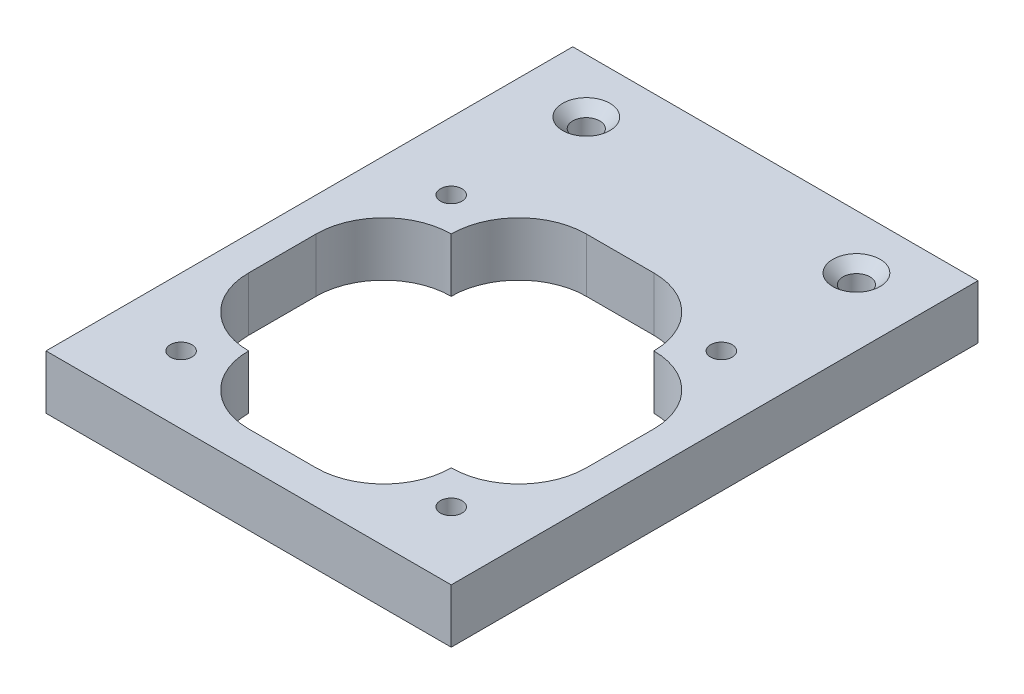
ISO-10303-21;
HEADER;
FILE_DESCRIPTION(('STEP AP214'),'2;1');
FILE_NAME('part.step','',(''),(''),'','','');
FILE_SCHEMA(('AUTOMOTIVE_DESIGN { 1 0 10303 214 1 1 1 1 }'));
ENDSEC;
DATA;
#1=APPLICATION_CONTEXT('core data for automotive mechanical design processes');
#2=APPLICATION_PROTOCOL_DEFINITION('international standard','automotive_design',2000,#1);
#3=PRODUCT_CONTEXT('',#1,'mechanical');
#4=PRODUCT('Part','Part','',(#3));
#5=PRODUCT_RELATED_PRODUCT_CATEGORY('part','',(#4));
#6=PRODUCT_DEFINITION_FORMATION('','',#4);
#7=PRODUCT_DEFINITION_CONTEXT('part definition',#1,'design');
#8=PRODUCT_DEFINITION('design','',#6,#7);
#9=PRODUCT_DEFINITION_SHAPE('','',#8);
#10=(LENGTH_UNIT() NAMED_UNIT(*) SI_UNIT(.MILLI.,.METRE.));
#11=(NAMED_UNIT(*) PLANE_ANGLE_UNIT() SI_UNIT($,.RADIAN.));
#12=(NAMED_UNIT(*) SI_UNIT($,.STERADIAN.) SOLID_ANGLE_UNIT());
#13=UNCERTAINTY_MEASURE_WITH_UNIT(LENGTH_MEASURE(1.E-05),#10,'distance_accuracy_value','');
#14=(GEOMETRIC_REPRESENTATION_CONTEXT(3) GLOBAL_UNCERTAINTY_ASSIGNED_CONTEXT((#13)) GLOBAL_UNIT_ASSIGNED_CONTEXT((#10,
#11,#12)) REPRESENTATION_CONTEXT('',''));
#15=CARTESIAN_POINT('',(0.,0.,0.));
#16=DIRECTION('',(0.,0.,1.));
#17=DIRECTION('',(1.,0.,0.));
#18=AXIS2_PLACEMENT_3D('',#15,#16,#17);
#19=CARTESIAN_POINT('',(0.,0.,0.));
#20=DIRECTION('',(0.,-1.,0.));
#21=DIRECTION('',(0.,0.,-1.));
#22=AXIS2_PLACEMENT_3D('',#19,#20,#21);
#23=PLANE('',#22);
#24=CARTESIAN_POINT('',(-2.5,0.,-7.5));
#25=DIRECTION('',(0.,-1.,0.));
#26=DIRECTION('',(0.,0.,-1.));
#27=AXIS2_PLACEMENT_3D('',#24,#25,#26);
#28=CIRCLE('',#27,5.);
#29=CARTESIAN_POINT('',(-2.5,0.,-12.5));
#30=VERTEX_POINT('',#29);
#31=CARTESIAN_POINT('',(-7.5,0.,-7.5));
#32=VERTEX_POINT('',#31);
#33=EDGE_CURVE('E286',#30,#32,#28,.F.);
#34=ORIENTED_EDGE('',*,*,#33,.T.);
#35=CARTESIAN_POINT('',(-7.5,0.,-2.5));
#36=DIRECTION('',(0.,-1.,0.));
#37=DIRECTION('',(0.,0.,-1.));
#38=AXIS2_PLACEMENT_3D('',#35,#36,#37);
#39=CIRCLE('',#38,5.);
#40=CARTESIAN_POINT('',(-12.5,0.,-2.5));
#41=VERTEX_POINT('',#40);
#42=EDGE_CURVE('E47',#32,#41,#39,.F.);
#43=ORIENTED_EDGE('',*,*,#42,.T.);
#44=DIRECTION('',(0.,0.,1.));
#45=VECTOR('',#44,1.);
#46=CARTESIAN_POINT('',(-12.5,0.,7.5));
#47=LINE('',#46,#45);
#48=CARTESIAN_POINT('',(-12.5,0.,2.5));
#49=VERTEX_POINT('',#48);
#50=EDGE_CURVE('E178',#41,#49,#47,.T.);
#51=ORIENTED_EDGE('',*,*,#50,.T.);
#52=CARTESIAN_POINT('',(-7.5,0.,2.5));
#53=DIRECTION('',(0.,-1.,0.));
#54=DIRECTION('',(0.,0.,-1.));
#55=AXIS2_PLACEMENT_3D('',#52,#53,#54);
#56=CIRCLE('',#55,5.);
#57=CARTESIAN_POINT('',(-7.5,0.,7.5));
#58=VERTEX_POINT('',#57);
#59=EDGE_CURVE('E164',#49,#58,#56,.F.);
#60=ORIENTED_EDGE('',*,*,#59,.T.);
#61=CARTESIAN_POINT('',(-2.5,0.,7.5));
#62=DIRECTION('',(0.,-1.,0.));
#63=DIRECTION('',(0.,0.,-1.));
#64=AXIS2_PLACEMENT_3D('',#61,#62,#63);
#65=CIRCLE('',#64,5.);
#66=CARTESIAN_POINT('',(-2.5,0.,12.5));
#67=VERTEX_POINT('',#66);
#68=EDGE_CURVE('E165',#58,#67,#65,.F.);
#69=ORIENTED_EDGE('',*,*,#68,.T.);
#70=DIRECTION('',(1.,0.,0.));
#71=VECTOR('',#70,1.);
#72=CARTESIAN_POINT('',(7.5,0.,12.5));
#73=LINE('',#72,#71);
#74=CARTESIAN_POINT('',(2.5,0.,12.5));
#75=VERTEX_POINT('',#74);
#76=EDGE_CURVE('E182',#67,#75,#73,.T.);
#77=ORIENTED_EDGE('',*,*,#76,.T.);
#78=CARTESIAN_POINT('',(2.5,0.,7.5));
#79=DIRECTION('',(0.,-1.,0.));
#80=DIRECTION('',(0.,0.,-1.));
#81=AXIS2_PLACEMENT_3D('',#78,#79,#80);
#82=CIRCLE('',#81,5.);
#83=CARTESIAN_POINT('',(7.5,0.,7.5));
#84=VERTEX_POINT('',#83);
#85=EDGE_CURVE('E274',#75,#84,#82,.F.);
#86=ORIENTED_EDGE('',*,*,#85,.T.);
#87=CARTESIAN_POINT('',(7.5,0.,2.5));
#88=DIRECTION('',(0.,-1.,0.));
#89=DIRECTION('',(0.,0.,-1.));
#90=AXIS2_PLACEMENT_3D('',#87,#88,#89);
#91=CIRCLE('',#90,5.);
#92=CARTESIAN_POINT('',(12.5,0.,2.5));
#93=VERTEX_POINT('',#92);
#94=EDGE_CURVE('E175',#84,#93,#91,.F.);
#95=ORIENTED_EDGE('',*,*,#94,.T.);
#96=DIRECTION('',(0.,0.,-1.));
#97=VECTOR('',#96,1.);
#98=CARTESIAN_POINT('',(12.5,0.,-7.5));
#99=LINE('',#98,#97);
#100=CARTESIAN_POINT('',(12.5,0.,-2.5));
#101=VERTEX_POINT('',#100);
#102=EDGE_CURVE('E218',#93,#101,#99,.T.);
#103=ORIENTED_EDGE('',*,*,#102,.T.);
#104=CARTESIAN_POINT('',(7.5,0.,-2.5));
#105=DIRECTION('',(0.,-1.,0.));
#106=DIRECTION('',(0.,0.,-1.));
#107=AXIS2_PLACEMENT_3D('',#104,#105,#106);
#108=CIRCLE('',#107,5.);
#109=CARTESIAN_POINT('',(7.5,0.,-7.5));
#110=VERTEX_POINT('',#109);
#111=EDGE_CURVE('E278',#101,#110,#108,.F.);
#112=ORIENTED_EDGE('',*,*,#111,.T.);
#113=CARTESIAN_POINT('',(2.5,0.,-7.5));
#114=DIRECTION('',(0.,-1.,0.));
#115=DIRECTION('',(0.,0.,-1.));
#116=AXIS2_PLACEMENT_3D('',#113,#114,#115);
#117=CIRCLE('',#116,5.);
#118=CARTESIAN_POINT('',(2.5,0.,-12.5));
#119=VERTEX_POINT('',#118);
#120=EDGE_CURVE('E282',#110,#119,#117,.F.);
#121=ORIENTED_EDGE('',*,*,#120,.T.);
#122=DIRECTION('',(-1.,0.,0.));
#123=VECTOR('',#122,1.);
#124=CARTESIAN_POINT('',(-7.5,0.,-12.5));
#125=LINE('',#124,#123);
#126=EDGE_CURVE('E208',#119,#30,#125,.T.);
#127=ORIENTED_EDGE('',*,*,#126,.T.);
#128=EDGE_LOOP('',(#34,#43,#51,#60,#69,#77,#86,#95,#103,#112,#121,#127));
#129=FACE_BOUND('',#128,.T.);
#130=DIRECTION('',(0.,0.,1.));
#131=VECTOR('',#130,1.);
#132=CARTESIAN_POINT('',(-15.,0.,-15.));
#133=LINE('',#132,#131);
#134=CARTESIAN_POINT('',(-15.,0.,-24.));
#135=VERTEX_POINT('',#134);
#136=CARTESIAN_POINT('',(-15.,0.,15.));
#137=VERTEX_POINT('',#136);
#138=EDGE_CURVE('E214',#135,#137,#133,.T.);
#139=ORIENTED_EDGE('',*,*,#138,.F.);
#140=DIRECTION('',(-1.,0.,0.));
#141=VECTOR('',#140,1.);
#142=CARTESIAN_POINT('',(-15.,0.,-24.));
#143=LINE('',#142,#141);
#144=CARTESIAN_POINT('',(15.,0.,-24.));
#145=VERTEX_POINT('',#144);
#146=EDGE_CURVE('E226',#145,#135,#143,.T.);
#147=ORIENTED_EDGE('',*,*,#146,.F.);
#148=DIRECTION('',(0.,0.,-1.));
#149=VECTOR('',#148,1.);
#150=CARTESIAN_POINT('',(15.,0.,-24.));
#151=LINE('',#150,#149);
#152=CARTESIAN_POINT('',(15.,0.,15.));
#153=VERTEX_POINT('',#152);
#154=EDGE_CURVE('E237',#153,#145,#151,.T.);
#155=ORIENTED_EDGE('',*,*,#154,.F.);
#156=DIRECTION('',(1.,0.,0.));
#157=VECTOR('',#156,1.);
#158=CARTESIAN_POINT('',(-15.,0.,15.));
#159=LINE('',#158,#157);
#160=EDGE_CURVE('E234',#137,#153,#159,.T.);
#161=ORIENTED_EDGE('',*,*,#160,.F.);
#162=EDGE_LOOP('',(#139,#147,#155,#161));
#163=FACE_BOUND('',#162,.T.);
#164=CARTESIAN_POINT('',(10.,0.,-20.));
#165=DIRECTION('',(0.,1.,0.));
#166=DIRECTION('',(0.,0.,1.));
#167=AXIS2_PLACEMENT_3D('',#164,#165,#166);
#168=CIRCLE('',#167,0.999999999999997);
#169=CARTESIAN_POINT('',(10.,0.,-19.));
#170=VERTEX_POINT('',#169);
#171=EDGE_CURVE('E193',#170,#170,#168,.T.);
#172=ORIENTED_EDGE('',*,*,#171,.T.);
#173=EDGE_LOOP('',(#172));
#174=FACE_BOUND('',#173,.T.);
#175=CARTESIAN_POINT('',(-10.,0.,-20.));
#176=DIRECTION('',(0.,1.,0.));
#177=DIRECTION('',(0.,0.,1.));
#178=AXIS2_PLACEMENT_3D('',#175,#176,#177);
#179=CIRCLE('',#178,0.999999999999997);
#180=CARTESIAN_POINT('',(-10.,0.,-19.));
#181=VERTEX_POINT('',#180);
#182=EDGE_CURVE('E442',#181,#181,#179,.T.);
#183=ORIENTED_EDGE('',*,*,#182,.T.);
#184=EDGE_LOOP('',(#183));
#185=FACE_BOUND('',#184,.T.);
#186=CARTESIAN_POINT('',(-10.,0.,10.));
#187=DIRECTION('',(0.,1.,0.));
#188=DIRECTION('',(0.,0.,1.));
#189=AXIS2_PLACEMENT_3D('',#186,#187,#188);
#190=CIRCLE('',#189,0.799999999999999);
#191=CARTESIAN_POINT('',(-10.,0.,10.8));
#192=VERTEX_POINT('',#191);
#193=EDGE_CURVE('E433',#192,#192,#190,.T.);
#194=ORIENTED_EDGE('',*,*,#193,.T.);
#195=EDGE_LOOP('',(#194));
#196=FACE_BOUND('',#195,.T.);
#197=CARTESIAN_POINT('',(10.,0.,10.));
#198=DIRECTION('',(0.,1.,0.));
#199=DIRECTION('',(0.,0.,1.));
#200=AXIS2_PLACEMENT_3D('',#197,#198,#199);
#201=CIRCLE('',#200,0.799999999999999);
#202=CARTESIAN_POINT('',(10.,0.,10.8));
#203=VERTEX_POINT('',#202);
#204=EDGE_CURVE('E427',#203,#203,#201,.T.);
#205=ORIENTED_EDGE('',*,*,#204,.T.);
#206=EDGE_LOOP('',(#205));
#207=FACE_BOUND('',#206,.T.);
#208=CARTESIAN_POINT('',(10.,0.,-10.));
#209=DIRECTION('',(0.,1.,0.));
#210=DIRECTION('',(0.,0.,1.));
#211=AXIS2_PLACEMENT_3D('',#208,#209,#210);
#212=CIRCLE('',#211,0.799999999999999);
#213=CARTESIAN_POINT('',(10.,0.,-9.20000000000001));
#214=VERTEX_POINT('',#213);
#215=EDGE_CURVE('E421',#214,#214,#212,.T.);
#216=ORIENTED_EDGE('',*,*,#215,.T.);
#217=EDGE_LOOP('',(#216));
#218=FACE_BOUND('',#217,.T.);
#219=CARTESIAN_POINT('',(-10.,0.,-10.));
#220=DIRECTION('',(0.,1.,0.));
#221=DIRECTION('',(0.,0.,1.));
#222=AXIS2_PLACEMENT_3D('',#219,#220,#221);
#223=CIRCLE('',#222,0.799999999999999);
#224=CARTESIAN_POINT('',(-10.,0.,-9.20000000000001));
#225=VERTEX_POINT('',#224);
#226=EDGE_CURVE('E411',#225,#225,#223,.T.);
#227=ORIENTED_EDGE('',*,*,#226,.T.);
#228=EDGE_LOOP('',(#227));
#229=FACE_BOUND('',#228,.T.);
#230=ADVANCED_FACE('F38',(#129,#163,#174,#185,#196,#207,#218,#229),#23,.T.);
#231=CARTESIAN_POINT('',(0.,4.,0.));
#232=DIRECTION('',(0.,-1.,0.));
#233=DIRECTION('',(0.,0.,-1.));
#234=AXIS2_PLACEMENT_3D('',#231,#232,#233);
#235=PLANE('',#234);
#236=CARTESIAN_POINT('',(-10.,4.,-10.));
#237=DIRECTION('',(0.,1.,0.));
#238=DIRECTION('',(0.,0.,1.));
#239=AXIS2_PLACEMENT_3D('',#236,#237,#238);
#240=CIRCLE('',#239,0.799999999999988);
#241=CARTESIAN_POINT('',(-10.,4.,-9.20000000000002));
#242=VERTEX_POINT('',#241);
#243=EDGE_CURVE('E414',#242,#242,#240,.T.);
#244=ORIENTED_EDGE('',*,*,#243,.F.);
#245=EDGE_LOOP('',(#244));
#246=FACE_BOUND('',#245,.T.);
#247=CARTESIAN_POINT('',(10.,4.,-10.));
#248=DIRECTION('',(0.,1.,0.));
#249=DIRECTION('',(0.,0.,1.));
#250=AXIS2_PLACEMENT_3D('',#247,#248,#249);
#251=CIRCLE('',#250,0.799999999999988);
#252=CARTESIAN_POINT('',(10.,4.,-9.20000000000002));
#253=VERTEX_POINT('',#252);
#254=EDGE_CURVE('E416',#253,#253,#251,.T.);
#255=ORIENTED_EDGE('',*,*,#254,.F.);
#256=EDGE_LOOP('',(#255));
#257=FACE_BOUND('',#256,.T.);
#258=CARTESIAN_POINT('',(10.,4.,10.));
#259=DIRECTION('',(0.,1.,0.));
#260=DIRECTION('',(0.,0.,1.));
#261=AXIS2_PLACEMENT_3D('',#258,#259,#260);
#262=CIRCLE('',#261,0.799999999999988);
#263=CARTESIAN_POINT('',(10.,4.,10.8));
#264=VERTEX_POINT('',#263);
#265=EDGE_CURVE('E424',#264,#264,#262,.T.);
#266=ORIENTED_EDGE('',*,*,#265,.F.);
#267=EDGE_LOOP('',(#266));
#268=FACE_BOUND('',#267,.T.);
#269=CARTESIAN_POINT('',(-10.,4.,10.));
#270=DIRECTION('',(0.,1.,0.));
#271=DIRECTION('',(0.,0.,1.));
#272=AXIS2_PLACEMENT_3D('',#269,#270,#271);
#273=CIRCLE('',#272,0.799999999999988);
#274=CARTESIAN_POINT('',(-10.,4.,10.8));
#275=VERTEX_POINT('',#274);
#276=EDGE_CURVE('E430',#275,#275,#273,.T.);
#277=ORIENTED_EDGE('',*,*,#276,.F.);
#278=EDGE_LOOP('',(#277));
#279=FACE_BOUND('',#278,.T.);
#280=CARTESIAN_POINT('',(-10.,4.,-20.));
#281=DIRECTION('',(0.,1.,0.));
#282=DIRECTION('',(0.,0.,1.));
#283=AXIS2_PLACEMENT_3D('',#280,#281,#282);
#284=CIRCLE('',#283,1.75);
#285=CARTESIAN_POINT('',(-10.,4.,-18.25));
#286=VERTEX_POINT('',#285);
#287=EDGE_CURVE('E436',#286,#286,#284,.T.);
#288=ORIENTED_EDGE('',*,*,#287,.F.);
#289=EDGE_LOOP('',(#288));
#290=FACE_BOUND('',#289,.T.);
#291=DIRECTION('',(0.,0.,1.));
#292=VECTOR('',#291,1.);
#293=CARTESIAN_POINT('',(-12.5,4.,7.5));
#294=LINE('',#293,#292);
#295=CARTESIAN_POINT('',(-12.5,4.,-2.5));
#296=VERTEX_POINT('',#295);
#297=CARTESIAN_POINT('',(-12.5,4.,2.5));
#298=VERTEX_POINT('',#297);
#299=EDGE_CURVE('E206',#296,#298,#294,.T.);
#300=ORIENTED_EDGE('',*,*,#299,.F.);
#301=CARTESIAN_POINT('',(-7.5,4.,-2.5));
#302=DIRECTION('',(0.,-1.,0.));
#303=DIRECTION('',(0.,0.,-1.));
#304=AXIS2_PLACEMENT_3D('',#301,#302,#303);
#305=CIRCLE('',#304,5.);
#306=CARTESIAN_POINT('',(-7.5,4.,-7.5));
#307=VERTEX_POINT('',#306);
#308=EDGE_CURVE('E11',#296,#307,#305,.T.);
#309=ORIENTED_EDGE('',*,*,#308,.T.);
#310=CARTESIAN_POINT('',(-2.5,4.,-7.5));
#311=DIRECTION('',(0.,-1.,0.));
#312=DIRECTION('',(0.,0.,-1.));
#313=AXIS2_PLACEMENT_3D('',#310,#311,#312);
#314=CIRCLE('',#313,5.);
#315=CARTESIAN_POINT('',(-2.5,4.,-12.5));
#316=VERTEX_POINT('',#315);
#317=EDGE_CURVE('E54',#307,#316,#314,.T.);
#318=ORIENTED_EDGE('',*,*,#317,.T.);
#319=DIRECTION('',(-1.,0.,0.));
#320=VECTOR('',#319,1.);
#321=CARTESIAN_POINT('',(-7.5,4.,-12.5));
#322=LINE('',#321,#320);
#323=CARTESIAN_POINT('',(2.5,4.,-12.5));
#324=VERTEX_POINT('',#323);
#325=EDGE_CURVE('E213',#324,#316,#322,.T.);
#326=ORIENTED_EDGE('',*,*,#325,.F.);
#327=CARTESIAN_POINT('',(2.5,4.,-7.5));
#328=DIRECTION('',(0.,-1.,0.));
#329=DIRECTION('',(0.,0.,-1.));
#330=AXIS2_PLACEMENT_3D('',#327,#328,#329);
#331=CIRCLE('',#330,5.);
#332=CARTESIAN_POINT('',(7.5,4.,-7.5));
#333=VERTEX_POINT('',#332);
#334=EDGE_CURVE('E284',#324,#333,#331,.T.);
#335=ORIENTED_EDGE('',*,*,#334,.T.);
#336=CARTESIAN_POINT('',(7.5,4.,-2.5));
#337=DIRECTION('',(0.,-1.,0.));
#338=DIRECTION('',(0.,0.,-1.));
#339=AXIS2_PLACEMENT_3D('',#336,#337,#338);
#340=CIRCLE('',#339,5.);
#341=CARTESIAN_POINT('',(12.5,4.,-2.5));
#342=VERTEX_POINT('',#341);
#343=EDGE_CURVE('E280',#333,#342,#340,.T.);
#344=ORIENTED_EDGE('',*,*,#343,.T.);
#345=DIRECTION('',(0.,0.,-1.));
#346=VECTOR('',#345,1.);
#347=CARTESIAN_POINT('',(12.5,4.,-7.5));
#348=LINE('',#347,#346);
#349=CARTESIAN_POINT('',(12.5,4.,2.5));
#350=VERTEX_POINT('',#349);
#351=EDGE_CURVE('E210',#350,#342,#348,.T.);
#352=ORIENTED_EDGE('',*,*,#351,.F.);
#353=CARTESIAN_POINT('',(7.5,4.,2.5));
#354=DIRECTION('',(0.,-1.,0.));
#355=DIRECTION('',(0.,0.,-1.));
#356=AXIS2_PLACEMENT_3D('',#353,#354,#355);
#357=CIRCLE('',#356,5.);
#358=CARTESIAN_POINT('',(7.5,4.,7.5));
#359=VERTEX_POINT('',#358);
#360=EDGE_CURVE('E272',#350,#359,#357,.T.);
#361=ORIENTED_EDGE('',*,*,#360,.T.);
#362=CARTESIAN_POINT('',(2.5,4.,7.5));
#363=DIRECTION('',(0.,-1.,0.));
#364=DIRECTION('',(0.,0.,-1.));
#365=AXIS2_PLACEMENT_3D('',#362,#363,#364);
#366=CIRCLE('',#365,5.);
#367=CARTESIAN_POINT('',(2.5,4.,12.5));
#368=VERTEX_POINT('',#367);
#369=EDGE_CURVE('E276',#359,#368,#366,.T.);
#370=ORIENTED_EDGE('',*,*,#369,.T.);
#371=DIRECTION('',(1.,0.,0.));
#372=VECTOR('',#371,1.);
#373=CARTESIAN_POINT('',(7.5,4.,12.5));
#374=LINE('',#373,#372);
#375=CARTESIAN_POINT('',(-2.5,4.,12.5));
#376=VERTEX_POINT('',#375);
#377=EDGE_CURVE('E159',#376,#368,#374,.T.);
#378=ORIENTED_EDGE('',*,*,#377,.F.);
#379=CARTESIAN_POINT('',(-2.5,4.,7.5));
#380=DIRECTION('',(0.,-1.,0.));
#381=DIRECTION('',(0.,0.,-1.));
#382=AXIS2_PLACEMENT_3D('',#379,#380,#381);
#383=CIRCLE('',#382,5.);
#384=CARTESIAN_POINT('',(-7.5,4.,7.5));
#385=VERTEX_POINT('',#384);
#386=EDGE_CURVE('E151',#376,#385,#383,.T.);
#387=ORIENTED_EDGE('',*,*,#386,.T.);
#388=CARTESIAN_POINT('',(-7.5,4.,2.5));
#389=DIRECTION('',(0.,-1.,0.));
#390=DIRECTION('',(0.,0.,-1.));
#391=AXIS2_PLACEMENT_3D('',#388,#389,#390);
#392=CIRCLE('',#391,5.);
#393=EDGE_CURVE('E156',#385,#298,#392,.T.);
#394=ORIENTED_EDGE('',*,*,#393,.T.);
#395=EDGE_LOOP('',(#300,#309,#318,#326,#335,#344,#352,#361,#370,#378,#387,#394));
#396=FACE_BOUND('',#395,.T.);
#397=DIRECTION('',(0.,0.,1.));
#398=VECTOR('',#397,1.);
#399=CARTESIAN_POINT('',(-15.,4.,-15.));
#400=LINE('',#399,#398);
#401=CARTESIAN_POINT('',(-15.,4.,-24.));
#402=VERTEX_POINT('',#401);
#403=CARTESIAN_POINT('',(-15.,4.,15.));
#404=VERTEX_POINT('',#403);
#405=EDGE_CURVE('E223',#402,#404,#400,.T.);
#406=ORIENTED_EDGE('',*,*,#405,.T.);
#407=DIRECTION('',(1.,0.,0.));
#408=VECTOR('',#407,1.);
#409=CARTESIAN_POINT('',(-15.,4.,15.));
#410=LINE('',#409,#408);
#411=CARTESIAN_POINT('',(15.,4.,15.));
#412=VERTEX_POINT('',#411);
#413=EDGE_CURVE('E225',#404,#412,#410,.T.);
#414=ORIENTED_EDGE('',*,*,#413,.T.);
#415=DIRECTION('',(0.,0.,-1.));
#416=VECTOR('',#415,1.);
#417=CARTESIAN_POINT('',(15.,4.,-15.));
#418=LINE('',#417,#416);
#419=CARTESIAN_POINT('',(15.,4.,-24.));
#420=VERTEX_POINT('',#419);
#421=EDGE_CURVE('E228',#412,#420,#418,.T.);
#422=ORIENTED_EDGE('',*,*,#421,.T.);
#423=DIRECTION('',(-1.,0.,0.));
#424=VECTOR('',#423,1.);
#425=CARTESIAN_POINT('',(-15.,4.,-24.));
#426=LINE('',#425,#424);
#427=EDGE_CURVE('E230',#420,#402,#426,.T.);
#428=ORIENTED_EDGE('',*,*,#427,.T.);
#429=EDGE_LOOP('',(#406,#414,#422,#428));
#430=FACE_BOUND('',#429,.T.);
#431=CARTESIAN_POINT('',(10.,4.,-20.));
#432=DIRECTION('',(0.,1.,0.));
#433=DIRECTION('',(0.,0.,1.));
#434=AXIS2_PLACEMENT_3D('',#431,#432,#433);
#435=CIRCLE('',#434,1.75);
#436=CARTESIAN_POINT('',(10.,4.,-18.25));
#437=VERTEX_POINT('',#436);
#438=EDGE_CURVE('E202',#437,#437,#435,.T.);
#439=ORIENTED_EDGE('',*,*,#438,.F.);
#440=EDGE_LOOP('',(#439));
#441=FACE_BOUND('',#440,.T.);
#442=ADVANCED_FACE('F154',(#246,#257,#268,#279,#290,#396,#430,#441),#235,.F.);
#443=CARTESIAN_POINT('',(-15.,4.,-15.));
#444=DIRECTION('',(1.,0.,0.));
#445=DIRECTION('',(0.,0.,-1.));
#446=AXIS2_PLACEMENT_3D('',#443,#444,#445);
#447=PLANE('',#446);
#448=ORIENTED_EDGE('',*,*,#138,.T.);
#449=DIRECTION('',(0.,-1.,0.));
#450=VECTOR('',#449,1.);
#451=CARTESIAN_POINT('',(-15.,4.,15.));
#452=LINE('',#451,#450);
#453=EDGE_CURVE('E249',#404,#137,#452,.T.);
#454=ORIENTED_EDGE('',*,*,#453,.F.);
#455=ORIENTED_EDGE('',*,*,#405,.F.);
#456=DIRECTION('',(0.,-1.,0.));
#457=VECTOR('',#456,1.);
#458=CARTESIAN_POINT('',(-15.,4.,-24.));
#459=LINE('',#458,#457);
#460=EDGE_CURVE('E232',#402,#135,#459,.T.);
#461=ORIENTED_EDGE('',*,*,#460,.T.);
#462=EDGE_LOOP('',(#448,#454,#455,#461));
#463=FACE_BOUND('',#462,.T.);
#464=ADVANCED_FACE('F326',(#463),#447,.F.);
#465=CARTESIAN_POINT('',(-15.,4.,15.));
#466=DIRECTION('',(0.,0.,-1.));
#467=DIRECTION('',(-1.,0.,0.));
#468=AXIS2_PLACEMENT_3D('',#465,#466,#467);
#469=PLANE('',#468);
#470=ORIENTED_EDGE('',*,*,#160,.T.);
#471=DIRECTION('',(0.,-1.,0.));
#472=VECTOR('',#471,1.);
#473=CARTESIAN_POINT('',(15.,4.,15.));
#474=LINE('',#473,#472);
#475=EDGE_CURVE('E246',#412,#153,#474,.T.);
#476=ORIENTED_EDGE('',*,*,#475,.F.);
#477=ORIENTED_EDGE('',*,*,#413,.F.);
#478=ORIENTED_EDGE('',*,*,#453,.T.);
#479=EDGE_LOOP('',(#470,#476,#477,#478));
#480=FACE_BOUND('',#479,.T.);
#481=ADVANCED_FACE('F338',(#480),#469,.F.);
#482=CARTESIAN_POINT('',(15.,4.,-24.));
#483=DIRECTION('',(-1.,0.,0.));
#484=DIRECTION('',(0.,0.,1.));
#485=AXIS2_PLACEMENT_3D('',#482,#483,#484);
#486=PLANE('',#485);
#487=ORIENTED_EDGE('',*,*,#154,.T.);
#488=DIRECTION('',(0.,-1.,0.));
#489=VECTOR('',#488,1.);
#490=CARTESIAN_POINT('',(15.,4.,-24.));
#491=LINE('',#490,#489);
#492=EDGE_CURVE('E243',#420,#145,#491,.T.);
#493=ORIENTED_EDGE('',*,*,#492,.F.);
#494=ORIENTED_EDGE('',*,*,#421,.F.);
#495=ORIENTED_EDGE('',*,*,#475,.T.);
#496=EDGE_LOOP('',(#487,#493,#494,#495));
#497=FACE_BOUND('',#496,.T.);
#498=ADVANCED_FACE('F334',(#497),#486,.F.);
#499=CARTESIAN_POINT('',(-15.,4.,-24.));
#500=DIRECTION('',(0.,0.,1.));
#501=DIRECTION('',(1.,0.,0.));
#502=AXIS2_PLACEMENT_3D('',#499,#500,#501);
#503=PLANE('',#502);
#504=ORIENTED_EDGE('',*,*,#146,.T.);
#505=ORIENTED_EDGE('',*,*,#460,.F.);
#506=ORIENTED_EDGE('',*,*,#427,.F.);
#507=ORIENTED_EDGE('',*,*,#492,.T.);
#508=EDGE_LOOP('',(#504,#505,#506,#507));
#509=FACE_BOUND('',#508,.T.);
#510=ADVANCED_FACE('F331',(#509),#503,.F.);
#511=CARTESIAN_POINT('',(-12.5,4.,7.5));
#512=DIRECTION('',(1.,0.,0.));
#513=DIRECTION('',(0.,0.,-1.));
#514=AXIS2_PLACEMENT_3D('',#511,#512,#513);
#515=PLANE('',#514);
#516=ORIENTED_EDGE('',*,*,#299,.T.);
#517=DIRECTION('',(0.,-1.,0.));
#518=VECTOR('',#517,1.);
#519=CARTESIAN_POINT('',(-12.5,0.,2.5));
#520=LINE('',#519,#518);
#521=EDGE_CURVE('E174',#298,#49,#520,.T.);
#522=ORIENTED_EDGE('',*,*,#521,.T.);
#523=ORIENTED_EDGE('',*,*,#50,.F.);
#524=DIRECTION('',(0.,-1.,0.));
#525=VECTOR('',#524,1.);
#526=CARTESIAN_POINT('',(-12.5,4.,-2.5));
#527=LINE('',#526,#525);
#528=EDGE_CURVE('E256',#41,#296,#527,.F.);
#529=ORIENTED_EDGE('',*,*,#528,.T.);
#530=EDGE_LOOP('',(#516,#522,#523,#529));
#531=FACE_BOUND('',#530,.T.);
#532=ADVANCED_FACE('F295',(#531),#515,.T.);
#533=CARTESIAN_POINT('',(7.5,4.,12.5));
#534=DIRECTION('',(0.,0.,-1.));
#535=DIRECTION('',(-1.,0.,0.));
#536=AXIS2_PLACEMENT_3D('',#533,#534,#535);
#537=PLANE('',#536);
#538=ORIENTED_EDGE('',*,*,#76,.F.);
#539=DIRECTION('',(0.,-1.,0.));
#540=VECTOR('',#539,1.);
#541=CARTESIAN_POINT('',(-2.5,4.,12.5));
#542=LINE('',#541,#540);
#543=EDGE_CURVE('E254',#67,#376,#542,.F.);
#544=ORIENTED_EDGE('',*,*,#543,.T.);
#545=ORIENTED_EDGE('',*,*,#377,.T.);
#546=DIRECTION('',(0.,-1.,0.));
#547=VECTOR('',#546,1.);
#548=CARTESIAN_POINT('',(2.5,0.,12.5));
#549=LINE('',#548,#547);
#550=EDGE_CURVE('E252',#368,#75,#549,.T.);
#551=ORIENTED_EDGE('',*,*,#550,.T.);
#552=EDGE_LOOP('',(#538,#544,#545,#551));
#553=FACE_BOUND('',#552,.T.);
#554=ADVANCED_FACE('F363',(#553),#537,.T.);
#555=CARTESIAN_POINT('',(12.5,4.,-7.5));
#556=DIRECTION('',(-1.,0.,0.));
#557=DIRECTION('',(0.,0.,1.));
#558=AXIS2_PLACEMENT_3D('',#555,#556,#557);
#559=PLANE('',#558);
#560=ORIENTED_EDGE('',*,*,#102,.F.);
#561=DIRECTION('',(0.,-1.,0.));
#562=VECTOR('',#561,1.);
#563=CARTESIAN_POINT('',(12.5,4.,2.5));
#564=LINE('',#563,#562);
#565=EDGE_CURVE('E262',#93,#350,#564,.F.);
#566=ORIENTED_EDGE('',*,*,#565,.T.);
#567=ORIENTED_EDGE('',*,*,#351,.T.);
#568=DIRECTION('',(0.,-1.,0.));
#569=VECTOR('',#568,1.);
#570=CARTESIAN_POINT('',(12.5,0.,-2.5));
#571=LINE('',#570,#569);
#572=EDGE_CURVE('E259',#342,#101,#571,.T.);
#573=ORIENTED_EDGE('',*,*,#572,.T.);
#574=EDGE_LOOP('',(#560,#566,#567,#573));
#575=FACE_BOUND('',#574,.T.);
#576=ADVANCED_FACE('F308',(#575),#559,.T.);
#577=CARTESIAN_POINT('',(-7.5,4.,-12.5));
#578=DIRECTION('',(0.,0.,1.));
#579=DIRECTION('',(1.,0.,0.));
#580=AXIS2_PLACEMENT_3D('',#577,#578,#579);
#581=PLANE('',#580);
#582=ORIENTED_EDGE('',*,*,#126,.F.);
#583=DIRECTION('',(0.,-1.,0.));
#584=VECTOR('',#583,1.);
#585=CARTESIAN_POINT('',(2.5,4.,-12.5));
#586=LINE('',#585,#584);
#587=EDGE_CURVE('E61',#119,#324,#586,.F.);
#588=ORIENTED_EDGE('',*,*,#587,.T.);
#589=ORIENTED_EDGE('',*,*,#325,.T.);
#590=DIRECTION('',(0.,-1.,0.));
#591=VECTOR('',#590,1.);
#592=CARTESIAN_POINT('',(-2.5,0.,-12.5));
#593=LINE('',#592,#591);
#594=EDGE_CURVE('E265',#316,#30,#593,.T.);
#595=ORIENTED_EDGE('',*,*,#594,.T.);
#596=EDGE_LOOP('',(#582,#588,#589,#595));
#597=FACE_BOUND('',#596,.T.);
#598=ADVANCED_FACE('F299',(#597),#581,.T.);
#599=CARTESIAN_POINT('',(-7.5,4.,2.5));
#600=DIRECTION('',(0.,1.,0.));
#601=DIRECTION('',(0.,0.,1.));
#602=AXIS2_PLACEMENT_3D('',#599,#600,#601);
#603=CYLINDRICAL_SURFACE('',#602,5.);
#604=ORIENTED_EDGE('',*,*,#521,.F.);
#605=ORIENTED_EDGE('',*,*,#393,.F.);
#606=DIRECTION('',(0.,-1.,0.));
#607=VECTOR('',#606,1.);
#608=CARTESIAN_POINT('',(-7.5,4.,7.5));
#609=LINE('',#608,#607);
#610=EDGE_CURVE('E172',#58,#385,#609,.F.);
#611=ORIENTED_EDGE('',*,*,#610,.F.);
#612=ORIENTED_EDGE('',*,*,#59,.F.);
#613=EDGE_LOOP('',(#604,#605,#611,#612));
#614=FACE_BOUND('',#613,.T.);
#615=ADVANCED_FACE('F170',(#614),#603,.F.);
#616=CARTESIAN_POINT('',(-2.5,4.,7.5));
#617=DIRECTION('',(0.,1.,0.));
#618=DIRECTION('',(0.,0.,1.));
#619=AXIS2_PLACEMENT_3D('',#616,#617,#618);
#620=CYLINDRICAL_SURFACE('',#619,5.);
#621=ORIENTED_EDGE('',*,*,#386,.F.);
#622=ORIENTED_EDGE('',*,*,#543,.F.);
#623=ORIENTED_EDGE('',*,*,#68,.F.);
#624=ORIENTED_EDGE('',*,*,#610,.T.);
#625=EDGE_LOOP('',(#621,#622,#623,#624));
#626=FACE_BOUND('',#625,.T.);
#627=ADVANCED_FACE('F177',(#626),#620,.F.);
#628=CARTESIAN_POINT('',(2.5,4.,7.5));
#629=DIRECTION('',(0.,1.,0.));
#630=DIRECTION('',(0.,0.,1.));
#631=AXIS2_PLACEMENT_3D('',#628,#629,#630);
#632=CYLINDRICAL_SURFACE('',#631,5.);
#633=ORIENTED_EDGE('',*,*,#550,.F.);
#634=ORIENTED_EDGE('',*,*,#369,.F.);
#635=DIRECTION('',(0.,-1.,0.));
#636=VECTOR('',#635,1.);
#637=CARTESIAN_POINT('',(7.5,4.,7.5));
#638=LINE('',#637,#636);
#639=EDGE_CURVE('E179',#84,#359,#638,.F.);
#640=ORIENTED_EDGE('',*,*,#639,.F.);
#641=ORIENTED_EDGE('',*,*,#85,.F.);
#642=EDGE_LOOP('',(#633,#634,#640,#641));
#643=FACE_BOUND('',#642,.T.);
#644=ADVANCED_FACE('F348',(#643),#632,.F.);
#645=CARTESIAN_POINT('',(7.5,4.,2.5));
#646=DIRECTION('',(0.,1.,0.));
#647=DIRECTION('',(0.,0.,1.));
#648=AXIS2_PLACEMENT_3D('',#645,#646,#647);
#649=CYLINDRICAL_SURFACE('',#648,5.);
#650=ORIENTED_EDGE('',*,*,#360,.F.);
#651=ORIENTED_EDGE('',*,*,#565,.F.);
#652=ORIENTED_EDGE('',*,*,#94,.F.);
#653=ORIENTED_EDGE('',*,*,#639,.T.);
#654=EDGE_LOOP('',(#650,#651,#652,#653));
#655=FACE_BOUND('',#654,.T.);
#656=ADVANCED_FACE('F317',(#655),#649,.F.);
#657=CARTESIAN_POINT('',(2.5,4.,-7.5));
#658=DIRECTION('',(0.,1.,0.));
#659=DIRECTION('',(0.,0.,1.));
#660=AXIS2_PLACEMENT_3D('',#657,#658,#659);
#661=CYLINDRICAL_SURFACE('',#660,5.);
#662=DIRECTION('',(0.,-1.,0.));
#663=VECTOR('',#662,1.);
#664=CARTESIAN_POINT('',(7.5,0.,-7.5));
#665=LINE('',#664,#663);
#666=EDGE_CURVE('E185',#333,#110,#665,.T.);
#667=ORIENTED_EDGE('',*,*,#666,.F.);
#668=ORIENTED_EDGE('',*,*,#334,.F.);
#669=ORIENTED_EDGE('',*,*,#587,.F.);
#670=ORIENTED_EDGE('',*,*,#120,.F.);
#671=EDGE_LOOP('',(#667,#668,#669,#670));
#672=FACE_BOUND('',#671,.T.);
#673=ADVANCED_FACE('F302',(#672),#661,.F.);
#674=CARTESIAN_POINT('',(7.5,4.,-2.5));
#675=DIRECTION('',(0.,1.,0.));
#676=DIRECTION('',(0.,0.,1.));
#677=AXIS2_PLACEMENT_3D('',#674,#675,#676);
#678=CYLINDRICAL_SURFACE('',#677,5.);
#679=ORIENTED_EDGE('',*,*,#343,.F.);
#680=ORIENTED_EDGE('',*,*,#666,.T.);
#681=ORIENTED_EDGE('',*,*,#111,.F.);
#682=ORIENTED_EDGE('',*,*,#572,.F.);
#683=EDGE_LOOP('',(#679,#680,#681,#682));
#684=FACE_BOUND('',#683,.T.);
#685=ADVANCED_FACE('F310',(#684),#678,.F.);
#686=CARTESIAN_POINT('',(-7.5,4.,-2.5));
#687=DIRECTION('',(0.,1.,0.));
#688=DIRECTION('',(0.,0.,1.));
#689=AXIS2_PLACEMENT_3D('',#686,#687,#688);
#690=CYLINDRICAL_SURFACE('',#689,5.);
#691=DIRECTION('',(0.,-1.,0.));
#692=VECTOR('',#691,1.);
#693=CARTESIAN_POINT('',(-7.5,0.,-7.5));
#694=LINE('',#693,#692);
#695=EDGE_CURVE('E42',#307,#32,#694,.T.);
#696=ORIENTED_EDGE('',*,*,#695,.F.);
#697=ORIENTED_EDGE('',*,*,#308,.F.);
#698=ORIENTED_EDGE('',*,*,#528,.F.);
#699=ORIENTED_EDGE('',*,*,#42,.F.);
#700=EDGE_LOOP('',(#696,#697,#698,#699));
#701=FACE_BOUND('',#700,.T.);
#702=ADVANCED_FACE('F40',(#701),#690,.F.);
#703=CARTESIAN_POINT('',(-2.5,4.,-7.5));
#704=DIRECTION('',(0.,1.,0.));
#705=DIRECTION('',(0.,0.,1.));
#706=AXIS2_PLACEMENT_3D('',#703,#704,#705);
#707=CYLINDRICAL_SURFACE('',#706,5.);
#708=ORIENTED_EDGE('',*,*,#317,.F.);
#709=ORIENTED_EDGE('',*,*,#695,.T.);
#710=ORIENTED_EDGE('',*,*,#33,.F.);
#711=ORIENTED_EDGE('',*,*,#594,.F.);
#712=EDGE_LOOP('',(#708,#709,#710,#711));
#713=FACE_BOUND('',#712,.T.);
#714=ADVANCED_FACE('F298',(#713),#707,.F.);
#715=CARTESIAN_POINT('',(10.,4.,-20.));
#716=DIRECTION('',(0.,1.,0.));
#717=DIRECTION('',(0.,0.,1.));
#718=AXIS2_PLACEMENT_3D('',#715,#716,#717);
#719=CYLINDRICAL_SURFACE('',#718,0.999999999999992);
#720=ORIENTED_EDGE('',*,*,#171,.F.);
#721=EDGE_LOOP('',(#720));
#722=FACE_BOUND('',#721,.T.);
#723=CARTESIAN_POINT('',(10.,3.24999999999999,-20.));
#724=DIRECTION('',(0.,1.,0.));
#725=DIRECTION('',(0.,0.,1.));
#726=AXIS2_PLACEMENT_3D('',#723,#724,#725);
#727=CIRCLE('',#726,0.999999999999987);
#728=CARTESIAN_POINT('',(10.,3.24999999999999,-19.));
#729=VERTEX_POINT('',#728);
#730=EDGE_CURVE('E197',#729,#729,#727,.T.);
#731=ORIENTED_EDGE('',*,*,#730,.T.);
#732=EDGE_LOOP('',(#731));
#733=FACE_BOUND('',#732,.T.);
#734=ADVANCED_FACE('F375',(#722,#733),#719,.F.);
#735=CARTESIAN_POINT('',(10.,4.,-20.));
#736=DIRECTION('',(0.,1.,0.));
#737=DIRECTION('',(0.,0.,1.));
#738=AXIS2_PLACEMENT_3D('',#735,#736,#737);
#739=CONICAL_SURFACE('',#738,1.75,0.785398163397446);
#740=ORIENTED_EDGE('',*,*,#730,.F.);
#741=EDGE_LOOP('',(#740));
#742=FACE_BOUND('',#741,.T.);
#743=ORIENTED_EDGE('',*,*,#438,.T.);
#744=EDGE_LOOP('',(#743));
#745=FACE_BOUND('',#744,.T.);
#746=ADVANCED_FACE('F378',(#742,#745),#739,.F.);
#747=CARTESIAN_POINT('',(-10.,4.,-20.));
#748=DIRECTION('',(0.,1.,0.));
#749=DIRECTION('',(0.,0.,1.));
#750=AXIS2_PLACEMENT_3D('',#747,#748,#749);
#751=CYLINDRICAL_SURFACE('',#750,0.999999999999992);
#752=ORIENTED_EDGE('',*,*,#182,.F.);
#753=EDGE_LOOP('',(#752));
#754=FACE_BOUND('',#753,.T.);
#755=CARTESIAN_POINT('',(-10.,3.24999999999999,-20.));
#756=DIRECTION('',(0.,1.,0.));
#757=DIRECTION('',(0.,0.,1.));
#758=AXIS2_PLACEMENT_3D('',#755,#756,#757);
#759=CIRCLE('',#758,0.999999999999987);
#760=CARTESIAN_POINT('',(-10.,3.24999999999999,-19.));
#761=VERTEX_POINT('',#760);
#762=EDGE_CURVE('E439',#761,#761,#759,.T.);
#763=ORIENTED_EDGE('',*,*,#762,.T.);
#764=EDGE_LOOP('',(#763));
#765=FACE_BOUND('',#764,.T.);
#766=ADVANCED_FACE('F382',(#754,#765),#751,.F.);
#767=CARTESIAN_POINT('',(-10.,4.,-20.));
#768=DIRECTION('',(0.,1.,0.));
#769=DIRECTION('',(0.,0.,1.));
#770=AXIS2_PLACEMENT_3D('',#767,#768,#769);
#771=CONICAL_SURFACE('',#770,1.75,0.785398163397446);
#772=ORIENTED_EDGE('',*,*,#762,.F.);
#773=EDGE_LOOP('',(#772));
#774=FACE_BOUND('',#773,.T.);
#775=ORIENTED_EDGE('',*,*,#287,.T.);
#776=EDGE_LOOP('',(#775));
#777=FACE_BOUND('',#776,.T.);
#778=ADVANCED_FACE('F386',(#774,#777),#771,.F.);
#779=CARTESIAN_POINT('',(-10.,4.,10.));
#780=DIRECTION('',(0.,1.,0.));
#781=DIRECTION('',(0.,0.,1.));
#782=AXIS2_PLACEMENT_3D('',#779,#780,#781);
#783=CYLINDRICAL_SURFACE('',#782,0.799999999999993);
#784=ORIENTED_EDGE('',*,*,#193,.F.);
#785=EDGE_LOOP('',(#784));
#786=FACE_BOUND('',#785,.T.);
#787=ORIENTED_EDGE('',*,*,#276,.T.);
#788=EDGE_LOOP('',(#787));
#789=FACE_BOUND('',#788,.T.);
#790=ADVANCED_FACE('F390',(#786,#789),#783,.F.);
#791=CARTESIAN_POINT('',(10.,4.,10.));
#792=DIRECTION('',(0.,1.,0.));
#793=DIRECTION('',(0.,0.,1.));
#794=AXIS2_PLACEMENT_3D('',#791,#792,#793);
#795=CYLINDRICAL_SURFACE('',#794,0.799999999999993);
#796=ORIENTED_EDGE('',*,*,#204,.F.);
#797=EDGE_LOOP('',(#796));
#798=FACE_BOUND('',#797,.T.);
#799=ORIENTED_EDGE('',*,*,#265,.T.);
#800=EDGE_LOOP('',(#799));
#801=FACE_BOUND('',#800,.T.);
#802=ADVANCED_FACE('F394',(#798,#801),#795,.F.);
#803=CARTESIAN_POINT('',(10.,4.,-10.));
#804=DIRECTION('',(0.,1.,0.));
#805=DIRECTION('',(0.,0.,1.));
#806=AXIS2_PLACEMENT_3D('',#803,#804,#805);
#807=CYLINDRICAL_SURFACE('',#806,0.799999999999993);
#808=ORIENTED_EDGE('',*,*,#215,.F.);
#809=EDGE_LOOP('',(#808));
#810=FACE_BOUND('',#809,.T.);
#811=ORIENTED_EDGE('',*,*,#254,.T.);
#812=EDGE_LOOP('',(#811));
#813=FACE_BOUND('',#812,.T.);
#814=ADVANCED_FACE('F398',(#810,#813),#807,.F.);
#815=CARTESIAN_POINT('',(-10.,4.,-10.));
#816=DIRECTION('',(0.,1.,0.));
#817=DIRECTION('',(0.,0.,1.));
#818=AXIS2_PLACEMENT_3D('',#815,#816,#817);
#819=CYLINDRICAL_SURFACE('',#818,0.799999999999993);
#820=ORIENTED_EDGE('',*,*,#226,.F.);
#821=EDGE_LOOP('',(#820));
#822=FACE_BOUND('',#821,.T.);
#823=ORIENTED_EDGE('',*,*,#243,.T.);
#824=EDGE_LOOP('',(#823));
#825=FACE_BOUND('',#824,.T.);
#826=ADVANCED_FACE('F402',(#822,#825),#819,.F.);
#827=CLOSED_SHELL('',(#230,#442,#464,#481,#498,#510,#532,#554,#576,#598,#615,#627,#644,#656,
#673,#685,#702,#714,#734,#746,#766,#778,#790,#802,#814,#826));
#828=MANIFOLD_SOLID_BREP('B2',#827);
#829=ADVANCED_BREP_SHAPE_REPRESENTATION('',(#18,#828),#14);
#830=SHAPE_DEFINITION_REPRESENTATION(#9,#829);
ENDSEC;
END-ISO-10303-21;
